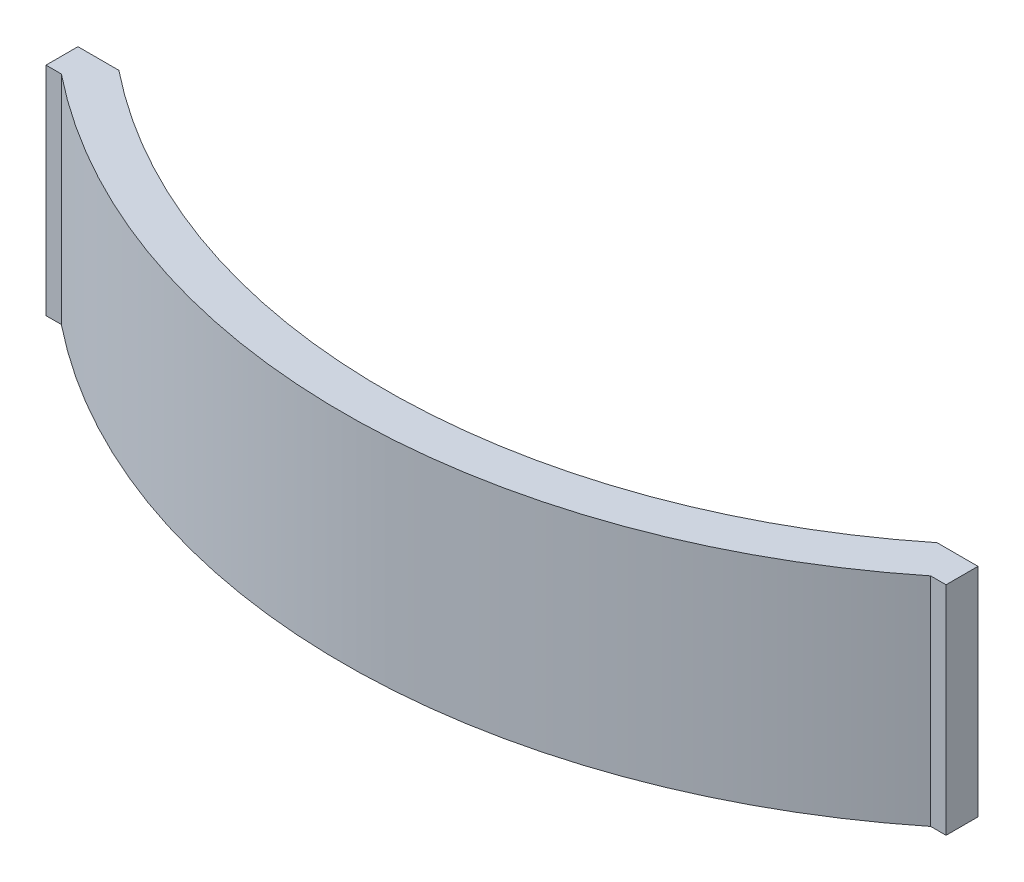
ISO-10303-21;
HEADER;
FILE_DESCRIPTION(('STEP AP214'),'2;1');
FILE_NAME('part.step','',(''),(''),'','','');
FILE_SCHEMA(('AUTOMOTIVE_DESIGN { 1 0 10303 214 1 1 1 1 }'));
ENDSEC;
DATA;
#1=APPLICATION_CONTEXT('core data for automotive mechanical design processes');
#2=APPLICATION_PROTOCOL_DEFINITION('international standard','automotive_design',2000,#1);
#3=PRODUCT_CONTEXT('',#1,'mechanical');
#4=PRODUCT('Part','Part','',(#3));
#5=PRODUCT_RELATED_PRODUCT_CATEGORY('part','',(#4));
#6=PRODUCT_DEFINITION_FORMATION('','',#4);
#7=PRODUCT_DEFINITION_CONTEXT('part definition',#1,'design');
#8=PRODUCT_DEFINITION('design','',#6,#7);
#9=PRODUCT_DEFINITION_SHAPE('','',#8);
#10=(LENGTH_UNIT() NAMED_UNIT(*) SI_UNIT(.MILLI.,.METRE.));
#11=(NAMED_UNIT(*) PLANE_ANGLE_UNIT() SI_UNIT($,.RADIAN.));
#12=(NAMED_UNIT(*) SI_UNIT($,.STERADIAN.) SOLID_ANGLE_UNIT());
#13=UNCERTAINTY_MEASURE_WITH_UNIT(LENGTH_MEASURE(1.E-05),#10,'distance_accuracy_value','');
#14=(GEOMETRIC_REPRESENTATION_CONTEXT(3) GLOBAL_UNCERTAINTY_ASSIGNED_CONTEXT((#13)) GLOBAL_UNIT_ASSIGNED_CONTEXT((#10,
#11,#12)) REPRESENTATION_CONTEXT('',''));
#15=CARTESIAN_POINT('',(0.,0.,0.));
#16=DIRECTION('',(0.,0.,1.));
#17=DIRECTION('',(1.,0.,0.));
#18=AXIS2_PLACEMENT_3D('',#15,#16,#17);
#19=CARTESIAN_POINT('',(-34.925635,16.8402,39.6557372898298));
#20=DIRECTION('',(0.,0.,-1.));
#21=DIRECTION('',(-1.,0.,0.));
#22=AXIS2_PLACEMENT_3D('',#19,#20,#21);
#23=PLANE('',#22);
#24=DIRECTION('',(1.,0.,0.));
#25=VECTOR('',#24,1.);
#26=CARTESIAN_POINT('',(-34.925635,0.,39.6557372898298));
#27=LINE('',#26,#25);
#28=CARTESIAN_POINT('',(-34.925635,0.,39.6557372898298));
#29=VERTEX_POINT('',#28);
#30=CARTESIAN_POINT('',(-31.75,0.,39.6557372898298));
#31=VERTEX_POINT('',#30);
#32=EDGE_CURVE('E134',#29,#31,#27,.T.);
#33=ORIENTED_EDGE('',*,*,#32,.F.);
#34=DIRECTION('',(0.,-1.,0.));
#35=VECTOR('',#34,1.);
#36=CARTESIAN_POINT('',(-34.925635,16.8402,39.6557372898298));
#37=LINE('',#36,#35);
#38=CARTESIAN_POINT('',(-34.925635,16.8402,39.6557372898298));
#39=VERTEX_POINT('',#38);
#40=EDGE_CURVE('E11',#39,#29,#37,.T.);
#41=ORIENTED_EDGE('',*,*,#40,.F.);
#42=DIRECTION('',(1.,0.,0.));
#43=VECTOR('',#42,1.);
#44=CARTESIAN_POINT('',(-34.925635,16.8402,39.6557372898298));
#45=LINE('',#44,#43);
#46=CARTESIAN_POINT('',(-31.75,16.8402,39.6557372898298));
#47=VERTEX_POINT('',#46);
#48=EDGE_CURVE('E151',#39,#47,#45,.T.);
#49=ORIENTED_EDGE('',*,*,#48,.T.);
#50=DIRECTION('',(0.,-1.,0.));
#51=VECTOR('',#50,1.);
#52=CARTESIAN_POINT('',(-31.75,16.8402,39.6557372898298));
#53=LINE('',#52,#51);
#54=EDGE_CURVE('E42',#47,#31,#53,.T.);
#55=ORIENTED_EDGE('',*,*,#54,.T.);
#56=EDGE_LOOP('',(#33,#41,#49,#55));
#57=FACE_BOUND('',#56,.T.);
#58=ADVANCED_FACE('F39',(#57),#23,.T.);
#59=CARTESIAN_POINT('',(-34.925635,16.8402,39.6557372898298));
#60=DIRECTION('',(1.,0.,0.));
#61=DIRECTION('',(0.,0.,-1.));
#62=AXIS2_PLACEMENT_3D('',#59,#60,#61);
#63=PLANE('',#62);
#64=DIRECTION('',(0.,0.,1.));
#65=VECTOR('',#64,1.);
#66=CARTESIAN_POINT('',(-34.925635,0.,39.6557372898298));
#67=LINE('',#66,#65);
#68=CARTESIAN_POINT('',(-34.925635,0.,42.1342208704442));
#69=VERTEX_POINT('',#68);
#70=EDGE_CURVE('E150',#29,#69,#67,.T.);
#71=ORIENTED_EDGE('',*,*,#70,.T.);
#72=DIRECTION('',(0.,-1.,0.));
#73=VECTOR('',#72,1.);
#74=CARTESIAN_POINT('',(-34.925635,16.8402,42.1342208704442));
#75=LINE('',#74,#73);
#76=CARTESIAN_POINT('',(-34.925635,16.8402,42.1342208704442));
#77=VERTEX_POINT('',#76);
#78=EDGE_CURVE('E48',#77,#69,#75,.T.);
#79=ORIENTED_EDGE('',*,*,#78,.F.);
#80=DIRECTION('',(0.,0.,1.));
#81=VECTOR('',#80,1.);
#82=CARTESIAN_POINT('',(-34.925635,16.8402,39.6557372898298));
#83=LINE('',#82,#81);
#84=EDGE_CURVE('E129',#39,#77,#83,.T.);
#85=ORIENTED_EDGE('',*,*,#84,.F.);
#86=ORIENTED_EDGE('',*,*,#40,.T.);
#87=EDGE_LOOP('',(#71,#79,#85,#86));
#88=FACE_BOUND('',#87,.T.);
#89=ADVANCED_FACE('F166',(#88),#63,.F.);
#90=CARTESIAN_POINT('',(-33.734375,16.8402,42.1342208704442));
#91=DIRECTION('',(0.,0.,1.));
#92=DIRECTION('',(1.,0.,0.));
#93=AXIS2_PLACEMENT_3D('',#90,#91,#92);
#94=PLANE('',#93);
#95=DIRECTION('',(-1.,0.,0.));
#96=VECTOR('',#95,1.);
#97=CARTESIAN_POINT('',(-33.734375,0.,42.1342208704442));
#98=LINE('',#97,#96);
#99=CARTESIAN_POINT('',(-33.734375,0.,42.1342208704442));
#100=VERTEX_POINT('',#99);
#101=EDGE_CURVE('E114',#100,#69,#98,.T.);
#102=ORIENTED_EDGE('',*,*,#101,.F.);
#103=DIRECTION('',(0.,-1.,0.));
#104=VECTOR('',#103,1.);
#105=CARTESIAN_POINT('',(-33.734375,16.8402,42.1342208704442));
#106=LINE('',#105,#104);
#107=CARTESIAN_POINT('',(-33.734375,16.8402,42.1342208704442));
#108=VERTEX_POINT('',#107);
#109=EDGE_CURVE('E108',#108,#100,#106,.T.);
#110=ORIENTED_EDGE('',*,*,#109,.F.);
#111=DIRECTION('',(-1.,0.,0.));
#112=VECTOR('',#111,1.);
#113=CARTESIAN_POINT('',(-33.734375,16.8402,42.1342208704442));
#114=LINE('',#113,#112);
#115=EDGE_CURVE('E112',#108,#77,#114,.T.);
#116=ORIENTED_EDGE('',*,*,#115,.T.);
#117=ORIENTED_EDGE('',*,*,#78,.T.);
#118=EDGE_LOOP('',(#102,#110,#116,#117));
#119=FACE_BOUND('',#118,.T.);
#120=ADVANCED_FACE('F110',(#119),#94,.T.);
#121=CARTESIAN_POINT('',(0.,16.8402,0.));
#122=DIRECTION('',(0.,-1.,0.));
#123=DIRECTION('',(0.,0.,-1.));
#124=AXIS2_PLACEMENT_3D('',#121,#122,#123);
#125=CYLINDRICAL_SURFACE('',#124,53.975);
#126=CARTESIAN_POINT('',(0.,0.,0.));
#127=DIRECTION('',(0.,1.,0.));
#128=DIRECTION('',(0.,0.,1.));
#129=AXIS2_PLACEMENT_3D('',#126,#127,#128);
#130=CIRCLE('',#129,53.975);
#131=CARTESIAN_POINT('',(33.734375,0.,42.1342208704442));
#132=VERTEX_POINT('',#131);
#133=EDGE_CURVE('E147',#100,#132,#130,.T.);
#134=ORIENTED_EDGE('',*,*,#133,.T.);
#135=DIRECTION('',(0.,-1.,0.));
#136=VECTOR('',#135,1.);
#137=CARTESIAN_POINT('',(33.734375,16.8402,42.1342208704442));
#138=LINE('',#137,#136);
#139=CARTESIAN_POINT('',(33.734375,16.8402,42.1342208704442));
#140=VERTEX_POINT('',#139);
#141=EDGE_CURVE('E117',#140,#132,#138,.T.);
#142=ORIENTED_EDGE('',*,*,#141,.F.);
#143=CARTESIAN_POINT('',(0.,16.8402,0.));
#144=DIRECTION('',(0.,1.,0.));
#145=DIRECTION('',(0.,0.,1.));
#146=AXIS2_PLACEMENT_3D('',#143,#144,#145);
#147=CIRCLE('',#146,53.975);
#148=EDGE_CURVE('E120',#108,#140,#147,.T.);
#149=ORIENTED_EDGE('',*,*,#148,.F.);
#150=ORIENTED_EDGE('',*,*,#109,.T.);
#151=EDGE_LOOP('',(#134,#142,#149,#150));
#152=FACE_BOUND('',#151,.T.);
#153=ADVANCED_FACE('F121',(#152),#125,.T.);
#154=CARTESIAN_POINT('',(33.734375,16.8402,42.1342208704442));
#155=DIRECTION('',(0.,0.,-1.));
#156=DIRECTION('',(-1.,0.,0.));
#157=AXIS2_PLACEMENT_3D('',#154,#155,#156);
#158=PLANE('',#157);
#159=DIRECTION('',(1.,0.,0.));
#160=VECTOR('',#159,1.);
#161=CARTESIAN_POINT('',(33.734375,0.,42.1342208704442));
#162=LINE('',#161,#160);
#163=CARTESIAN_POINT('',(34.925635,0.,42.1342208704442));
#164=VERTEX_POINT('',#163);
#165=EDGE_CURVE('E145',#132,#164,#162,.T.);
#166=ORIENTED_EDGE('',*,*,#165,.T.);
#167=DIRECTION('',(0.,-1.,0.));
#168=VECTOR('',#167,1.);
#169=CARTESIAN_POINT('',(34.925635,16.8402,42.1342208704442));
#170=LINE('',#169,#168);
#171=CARTESIAN_POINT('',(34.925635,16.8402,42.1342208704442));
#172=VERTEX_POINT('',#171);
#173=EDGE_CURVE('E155',#172,#164,#170,.T.);
#174=ORIENTED_EDGE('',*,*,#173,.F.);
#175=DIRECTION('',(1.,0.,0.));
#176=VECTOR('',#175,1.);
#177=CARTESIAN_POINT('',(33.734375,16.8402,42.1342208704442));
#178=LINE('',#177,#176);
#179=EDGE_CURVE('E125',#140,#172,#178,.T.);
#180=ORIENTED_EDGE('',*,*,#179,.F.);
#181=ORIENTED_EDGE('',*,*,#141,.T.);
#182=EDGE_LOOP('',(#166,#174,#180,#181));
#183=FACE_BOUND('',#182,.T.);
#184=ADVANCED_FACE('F178',(#183),#158,.F.);
#185=CARTESIAN_POINT('',(34.925635,16.8402,42.1342208704442));
#186=DIRECTION('',(-1.,0.,0.));
#187=DIRECTION('',(0.,0.,1.));
#188=AXIS2_PLACEMENT_3D('',#185,#186,#187);
#189=PLANE('',#188);
#190=DIRECTION('',(0.,0.,-1.));
#191=VECTOR('',#190,1.);
#192=CARTESIAN_POINT('',(34.925635,0.,42.1342208704442));
#193=LINE('',#192,#191);
#194=CARTESIAN_POINT('',(34.925635,0.,39.6557373844442));
#195=VERTEX_POINT('',#194);
#196=EDGE_CURVE('E143',#164,#195,#193,.T.);
#197=ORIENTED_EDGE('',*,*,#196,.T.);
#198=DIRECTION('',(0.,-1.,0.));
#199=VECTOR('',#198,1.);
#200=CARTESIAN_POINT('',(34.925635,16.8402,39.6557373844442));
#201=LINE('',#200,#199);
#202=CARTESIAN_POINT('',(34.925635,16.8402,39.6557373844442));
#203=VERTEX_POINT('',#202);
#204=EDGE_CURVE('E158',#203,#195,#201,.T.);
#205=ORIENTED_EDGE('',*,*,#204,.F.);
#206=DIRECTION('',(0.,0.,-1.));
#207=VECTOR('',#206,1.);
#208=CARTESIAN_POINT('',(34.925635,16.8402,42.1342208704442));
#209=LINE('',#208,#207);
#210=EDGE_CURVE('E173',#172,#203,#209,.T.);
#211=ORIENTED_EDGE('',*,*,#210,.F.);
#212=ORIENTED_EDGE('',*,*,#173,.T.);
#213=EDGE_LOOP('',(#197,#205,#211,#212));
#214=FACE_BOUND('',#213,.T.);
#215=ADVANCED_FACE('F182',(#214),#189,.F.);
#216=CARTESIAN_POINT('',(34.925635,16.8402,39.6557373844442));
#217=DIRECTION('',(-2.97938412172172E-08,0.,1.));
#218=DIRECTION('',(1.,0.,2.97938412172172E-08));
#219=AXIS2_PLACEMENT_3D('',#216,#217,#218);
#220=PLANE('',#219);
#221=DIRECTION('',(-1.,0.,-2.97938412172172E-08));
#222=VECTOR('',#221,1.);
#223=CARTESIAN_POINT('',(34.925635,0.,39.6557373844442));
#224=LINE('',#223,#222);
#225=CARTESIAN_POINT('',(31.75,0.,39.6557372898298));
#226=VERTEX_POINT('',#225);
#227=EDGE_CURVE('E140',#195,#226,#224,.T.);
#228=ORIENTED_EDGE('',*,*,#227,.T.);
#229=DIRECTION('',(0.,-1.,0.));
#230=VECTOR('',#229,1.);
#231=CARTESIAN_POINT('',(31.75,16.8402,39.6557372898298));
#232=LINE('',#231,#230);
#233=CARTESIAN_POINT('',(31.75,16.8402,39.6557372898298));
#234=VERTEX_POINT('',#233);
#235=EDGE_CURVE('E160',#234,#226,#232,.T.);
#236=ORIENTED_EDGE('',*,*,#235,.F.);
#237=DIRECTION('',(-1.,0.,-2.97938412172172E-08));
#238=VECTOR('',#237,1.);
#239=CARTESIAN_POINT('',(34.925635,16.8402,39.6557373844442));
#240=LINE('',#239,#238);
#241=EDGE_CURVE('E169',#203,#234,#240,.T.);
#242=ORIENTED_EDGE('',*,*,#241,.F.);
#243=ORIENTED_EDGE('',*,*,#204,.T.);
#244=EDGE_LOOP('',(#228,#236,#242,#243));
#245=FACE_BOUND('',#244,.T.);
#246=ADVANCED_FACE('F185',(#245),#220,.F.);
#247=CARTESIAN_POINT('',(0.,16.8402,0.));
#248=DIRECTION('',(0.,-1.,0.));
#249=DIRECTION('',(0.,0.,-1.));
#250=AXIS2_PLACEMENT_3D('',#247,#248,#249);
#251=CYLINDRICAL_SURFACE('',#250,50.8);
#252=CARTESIAN_POINT('',(0.,0.,0.));
#253=DIRECTION('',(0.,1.,0.));
#254=DIRECTION('',(0.,0.,1.));
#255=AXIS2_PLACEMENT_3D('',#252,#253,#254);
#256=CIRCLE('',#255,50.8);
#257=EDGE_CURVE('E137',#31,#226,#256,.T.);
#258=ORIENTED_EDGE('',*,*,#257,.F.);
#259=ORIENTED_EDGE('',*,*,#54,.F.);
#260=CARTESIAN_POINT('',(0.,16.8402,0.));
#261=DIRECTION('',(0.,1.,0.));
#262=DIRECTION('',(0.,0.,1.));
#263=AXIS2_PLACEMENT_3D('',#260,#261,#262);
#264=CIRCLE('',#263,50.8);
#265=EDGE_CURVE('E167',#47,#234,#264,.T.);
#266=ORIENTED_EDGE('',*,*,#265,.T.);
#267=ORIENTED_EDGE('',*,*,#235,.T.);
#268=EDGE_LOOP('',(#258,#259,#266,#267));
#269=FACE_BOUND('',#268,.T.);
#270=ADVANCED_FACE('F162',(#269),#251,.F.);
#271=CARTESIAN_POINT('',(0.,16.8402,0.));
#272=DIRECTION('',(0.,1.,0.));
#273=DIRECTION('',(0.,0.,1.));
#274=AXIS2_PLACEMENT_3D('',#271,#272,#273);
#275=PLANE('',#274);
#276=ORIENTED_EDGE('',*,*,#48,.F.);
#277=ORIENTED_EDGE('',*,*,#84,.T.);
#278=ORIENTED_EDGE('',*,*,#115,.F.);
#279=ORIENTED_EDGE('',*,*,#148,.T.);
#280=ORIENTED_EDGE('',*,*,#179,.T.);
#281=ORIENTED_EDGE('',*,*,#210,.T.);
#282=ORIENTED_EDGE('',*,*,#241,.T.);
#283=ORIENTED_EDGE('',*,*,#265,.F.);
#284=EDGE_LOOP('',(#276,#277,#278,#279,#280,#281,#282,#283));
#285=FACE_BOUND('',#284,.T.);
#286=ADVANCED_FACE('F128',(#285),#275,.T.);
#287=CARTESIAN_POINT('',(0.,0.,0.));
#288=DIRECTION('',(0.,1.,0.));
#289=DIRECTION('',(0.,0.,1.));
#290=AXIS2_PLACEMENT_3D('',#287,#288,#289);
#291=PLANE('',#290);
#292=ORIENTED_EDGE('',*,*,#32,.T.);
#293=ORIENTED_EDGE('',*,*,#257,.T.);
#294=ORIENTED_EDGE('',*,*,#227,.F.);
#295=ORIENTED_EDGE('',*,*,#196,.F.);
#296=ORIENTED_EDGE('',*,*,#165,.F.);
#297=ORIENTED_EDGE('',*,*,#133,.F.);
#298=ORIENTED_EDGE('',*,*,#101,.T.);
#299=ORIENTED_EDGE('',*,*,#70,.F.);
#300=EDGE_LOOP('',(#292,#293,#294,#295,#296,#297,#298,#299));
#301=FACE_BOUND('',#300,.T.);
#302=ADVANCED_FACE('F165',(#301),#291,.F.);
#303=CLOSED_SHELL('',(#58,#89,#120,#153,#184,#215,#246,#270,#286,#302));
#304=MANIFOLD_SOLID_BREP('B2',#303);
#305=ADVANCED_BREP_SHAPE_REPRESENTATION('',(#18,#304),#14);
#306=SHAPE_DEFINITION_REPRESENTATION(#9,#305);
ENDSEC;
END-ISO-10303-21;
